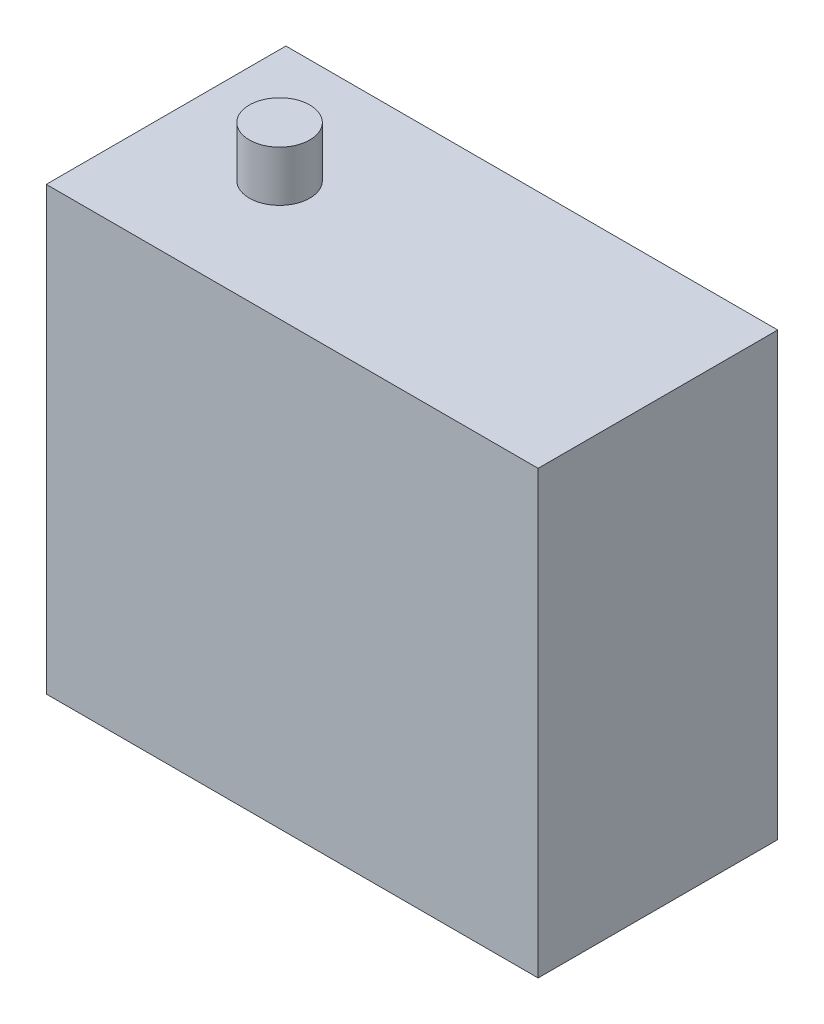
ISO-10303-21;
HEADER;
FILE_DESCRIPTION(('STEP AP214'),'2;1');
FILE_NAME('part.step','',(''),(''),'','','');
FILE_SCHEMA(('AUTOMOTIVE_DESIGN { 1 0 10303 214 1 1 1 1 }'));
ENDSEC;
DATA;
#1=APPLICATION_CONTEXT('core data for automotive mechanical design processes');
#2=APPLICATION_PROTOCOL_DEFINITION('international standard','automotive_design',2000,#1);
#3=PRODUCT_CONTEXT('',#1,'mechanical');
#4=PRODUCT('Part','Part','',(#3));
#5=PRODUCT_RELATED_PRODUCT_CATEGORY('part','',(#4));
#6=PRODUCT_DEFINITION_FORMATION('','',#4);
#7=PRODUCT_DEFINITION_CONTEXT('part definition',#1,'design');
#8=PRODUCT_DEFINITION('design','',#6,#7);
#9=PRODUCT_DEFINITION_SHAPE('','',#8);
#10=(LENGTH_UNIT() NAMED_UNIT(*) SI_UNIT(.MILLI.,.METRE.));
#11=(NAMED_UNIT(*) PLANE_ANGLE_UNIT() SI_UNIT($,.RADIAN.));
#12=(NAMED_UNIT(*) SI_UNIT($,.STERADIAN.) SOLID_ANGLE_UNIT());
#13=UNCERTAINTY_MEASURE_WITH_UNIT(LENGTH_MEASURE(1.E-05),#10,'distance_accuracy_value','');
#14=(GEOMETRIC_REPRESENTATION_CONTEXT(3) GLOBAL_UNCERTAINTY_ASSIGNED_CONTEXT((#13)) GLOBAL_UNIT_ASSIGNED_CONTEXT((#10,
#11,#12)) REPRESENTATION_CONTEXT('',''));
#15=CARTESIAN_POINT('',(0.,0.,0.));
#16=DIRECTION('',(0.,0.,1.));
#17=DIRECTION('',(1.,0.,0.));
#18=AXIS2_PLACEMENT_3D('',#15,#16,#17);
#19=CARTESIAN_POINT('',(-19.5,35.,9.50000000000001));
#20=DIRECTION('',(1.,0.,0.));
#21=DIRECTION('',(0.,0.,-1.));
#22=AXIS2_PLACEMENT_3D('',#19,#20,#21);
#23=PLANE('',#22);
#24=DIRECTION('',(0.,0.,1.));
#25=VECTOR('',#24,1.);
#26=CARTESIAN_POINT('',(-19.5,0.,9.50000000000001));
#27=LINE('',#26,#25);
#28=CARTESIAN_POINT('',(-19.5,0.,-9.49999999999999));
#29=VERTEX_POINT('',#28);
#30=CARTESIAN_POINT('',(-19.5,0.,9.50000000000001));
#31=VERTEX_POINT('',#30);
#32=EDGE_CURVE('E104',#29,#31,#27,.T.);
#33=ORIENTED_EDGE('',*,*,#32,.T.);
#34=DIRECTION('',(0.,-1.,0.));
#35=VECTOR('',#34,1.);
#36=CARTESIAN_POINT('',(-19.5,35.,9.50000000000001));
#37=LINE('',#36,#35);
#38=CARTESIAN_POINT('',(-19.5,35.,9.50000000000001));
#39=VERTEX_POINT('',#38);
#40=EDGE_CURVE('E11',#39,#31,#37,.T.);
#41=ORIENTED_EDGE('',*,*,#40,.F.);
#42=DIRECTION('',(0.,0.,1.));
#43=VECTOR('',#42,1.);
#44=CARTESIAN_POINT('',(-19.5,35.,9.50000000000001));
#45=LINE('',#44,#43);
#46=CARTESIAN_POINT('',(-19.5,35.,-9.49999999999999));
#47=VERTEX_POINT('',#46);
#48=EDGE_CURVE('E92',#47,#39,#45,.T.);
#49=ORIENTED_EDGE('',*,*,#48,.F.);
#50=DIRECTION('',(0.,-1.,0.));
#51=VECTOR('',#50,1.);
#52=CARTESIAN_POINT('',(-19.5,35.,-9.49999999999999));
#53=LINE('',#52,#51);
#54=EDGE_CURVE('E100',#47,#29,#53,.T.);
#55=ORIENTED_EDGE('',*,*,#54,.T.);
#56=EDGE_LOOP('',(#33,#41,#49,#55));
#57=FACE_BOUND('',#56,.T.);
#58=ADVANCED_FACE('F41',(#57),#23,.F.);
#59=CARTESIAN_POINT('',(19.5,35.,9.5));
#60=DIRECTION('',(0.,0.,-1.));
#61=DIRECTION('',(-1.,0.,0.));
#62=AXIS2_PLACEMENT_3D('',#59,#60,#61);
#63=PLANE('',#62);
#64=DIRECTION('',(1.,0.,0.));
#65=VECTOR('',#64,1.);
#66=CARTESIAN_POINT('',(19.5,0.,9.5));
#67=LINE('',#66,#65);
#68=CARTESIAN_POINT('',(19.5,0.,9.5));
#69=VERTEX_POINT('',#68);
#70=EDGE_CURVE('E96',#31,#69,#67,.T.);
#71=ORIENTED_EDGE('',*,*,#70,.T.);
#72=DIRECTION('',(0.,-1.,0.));
#73=VECTOR('',#72,1.);
#74=CARTESIAN_POINT('',(19.5,35.,9.5));
#75=LINE('',#74,#73);
#76=CARTESIAN_POINT('',(19.5,35.,9.5));
#77=VERTEX_POINT('',#76);
#78=EDGE_CURVE('E49',#77,#69,#75,.T.);
#79=ORIENTED_EDGE('',*,*,#78,.F.);
#80=DIRECTION('',(1.,0.,0.));
#81=VECTOR('',#80,1.);
#82=CARTESIAN_POINT('',(19.5,35.,9.5));
#83=LINE('',#82,#81);
#84=EDGE_CURVE('E87',#39,#77,#83,.T.);
#85=ORIENTED_EDGE('',*,*,#84,.F.);
#86=ORIENTED_EDGE('',*,*,#40,.T.);
#87=EDGE_LOOP('',(#71,#79,#85,#86));
#88=FACE_BOUND('',#87,.T.);
#89=ADVANCED_FACE('F95',(#88),#63,.F.);
#90=CARTESIAN_POINT('',(19.5,35.,9.5));
#91=DIRECTION('',(-1.,0.,0.));
#92=DIRECTION('',(0.,0.,1.));
#93=AXIS2_PLACEMENT_3D('',#90,#91,#92);
#94=PLANE('',#93);
#95=DIRECTION('',(0.,0.,-1.));
#96=VECTOR('',#95,1.);
#97=CARTESIAN_POINT('',(19.5,0.,9.5));
#98=LINE('',#97,#96);
#99=CARTESIAN_POINT('',(19.5,0.,-9.5));
#100=VERTEX_POINT('',#99);
#101=EDGE_CURVE('E74',#69,#100,#98,.T.);
#102=ORIENTED_EDGE('',*,*,#101,.T.);
#103=DIRECTION('',(0.,-1.,0.));
#104=VECTOR('',#103,1.);
#105=CARTESIAN_POINT('',(19.5,35.,-9.5));
#106=LINE('',#105,#104);
#107=CARTESIAN_POINT('',(19.5,35.,-9.5));
#108=VERTEX_POINT('',#107);
#109=EDGE_CURVE('E97',#108,#100,#106,.T.);
#110=ORIENTED_EDGE('',*,*,#109,.F.);
#111=DIRECTION('',(0.,0.,-1.));
#112=VECTOR('',#111,1.);
#113=CARTESIAN_POINT('',(19.5,35.,9.5));
#114=LINE('',#113,#112);
#115=EDGE_CURVE('E90',#77,#108,#114,.T.);
#116=ORIENTED_EDGE('',*,*,#115,.F.);
#117=ORIENTED_EDGE('',*,*,#78,.T.);
#118=EDGE_LOOP('',(#102,#110,#116,#117));
#119=FACE_BOUND('',#118,.T.);
#120=ADVANCED_FACE('F98',(#119),#94,.F.);
#121=CARTESIAN_POINT('',(19.5,35.,-9.5));
#122=DIRECTION('',(0.,0.,1.));
#123=DIRECTION('',(1.,0.,0.));
#124=AXIS2_PLACEMENT_3D('',#121,#122,#123);
#125=PLANE('',#124);
#126=DIRECTION('',(-1.,0.,0.));
#127=VECTOR('',#126,1.);
#128=CARTESIAN_POINT('',(19.5,0.,-9.5));
#129=LINE('',#128,#127);
#130=EDGE_CURVE('E80',#100,#29,#129,.T.);
#131=ORIENTED_EDGE('',*,*,#130,.T.);
#132=ORIENTED_EDGE('',*,*,#54,.F.);
#133=DIRECTION('',(-1.,0.,0.));
#134=VECTOR('',#133,1.);
#135=CARTESIAN_POINT('',(19.5,35.,-9.5));
#136=LINE('',#135,#134);
#137=EDGE_CURVE('E57',#108,#47,#136,.T.);
#138=ORIENTED_EDGE('',*,*,#137,.F.);
#139=ORIENTED_EDGE('',*,*,#109,.T.);
#140=EDGE_LOOP('',(#131,#132,#138,#139));
#141=FACE_BOUND('',#140,.T.);
#142=ADVANCED_FACE('F112',(#141),#125,.F.);
#143=CARTESIAN_POINT('',(0.,35.,0.));
#144=DIRECTION('',(0.,1.,0.));
#145=DIRECTION('',(0.,0.,1.));
#146=AXIS2_PLACEMENT_3D('',#143,#144,#145);
#147=PLANE('',#146);
#148=CARTESIAN_POINT('',(-10.5,35.,0.));
#149=DIRECTION('',(0.,1.,0.));
#150=DIRECTION('',(0.,0.,1.));
#151=AXIS2_PLACEMENT_3D('',#148,#149,#150);
#152=CIRCLE('',#151,2.4);
#153=CARTESIAN_POINT('',(-10.5,35.,2.4));
#154=VERTEX_POINT('',#153);
#155=EDGE_CURVE('E118',#154,#154,#152,.T.);
#156=ORIENTED_EDGE('',*,*,#155,.F.);
#157=EDGE_LOOP('',(#156));
#158=FACE_BOUND('',#157,.T.);
#159=ORIENTED_EDGE('',*,*,#48,.T.);
#160=ORIENTED_EDGE('',*,*,#84,.T.);
#161=ORIENTED_EDGE('',*,*,#115,.T.);
#162=ORIENTED_EDGE('',*,*,#137,.T.);
#163=EDGE_LOOP('',(#159,#160,#161,#162));
#164=FACE_BOUND('',#163,.T.);
#165=ADVANCED_FACE('F88',(#158,#164),#147,.T.);
#166=CARTESIAN_POINT('',(0.,0.,0.));
#167=DIRECTION('',(0.,1.,0.));
#168=DIRECTION('',(0.,0.,1.));
#169=AXIS2_PLACEMENT_3D('',#166,#167,#168);
#170=PLANE('',#169);
#171=ORIENTED_EDGE('',*,*,#32,.F.);
#172=ORIENTED_EDGE('',*,*,#130,.F.);
#173=ORIENTED_EDGE('',*,*,#101,.F.);
#174=ORIENTED_EDGE('',*,*,#70,.F.);
#175=EDGE_LOOP('',(#171,#172,#173,#174));
#176=FACE_BOUND('',#175,.T.);
#177=ADVANCED_FACE('F115',(#176),#170,.F.);
#178=CARTESIAN_POINT('',(-10.5,39.,0.));
#179=DIRECTION('',(0.,-1.,0.));
#180=DIRECTION('',(0.,0.,-1.));
#181=AXIS2_PLACEMENT_3D('',#178,#179,#180);
#182=CYLINDRICAL_SURFACE('',#181,2.4);
#183=CARTESIAN_POINT('',(-10.5,39.,0.));
#184=DIRECTION('',(0.,1.,0.));
#185=DIRECTION('',(0.,0.,1.));
#186=AXIS2_PLACEMENT_3D('',#183,#184,#185);
#187=CIRCLE('',#186,2.4);
#188=CARTESIAN_POINT('',(-10.5,39.,2.4));
#189=VERTEX_POINT('',#188);
#190=EDGE_CURVE('E107',#189,#189,#187,.T.);
#191=ORIENTED_EDGE('',*,*,#190,.F.);
#192=EDGE_LOOP('',(#191));
#193=FACE_BOUND('',#192,.T.);
#194=ORIENTED_EDGE('',*,*,#155,.T.);
#195=EDGE_LOOP('',(#194));
#196=FACE_BOUND('',#195,.T.);
#197=ADVANCED_FACE('F126',(#193,#196),#182,.T.);
#198=CARTESIAN_POINT('',(-10.5,39.,0.));
#199=DIRECTION('',(0.,1.,0.));
#200=DIRECTION('',(0.,0.,1.));
#201=AXIS2_PLACEMENT_3D('',#198,#199,#200);
#202=PLANE('',#201);
#203=ORIENTED_EDGE('',*,*,#190,.T.);
#204=EDGE_LOOP('',(#203));
#205=FACE_BOUND('',#204,.T.);
#206=ADVANCED_FACE('F124',(#205),#202,.T.);
#207=CLOSED_SHELL('',(#58,#89,#120,#142,#165,#177,#197,#206));
#208=MANIFOLD_SOLID_BREP('B2',#207);
#209=ADVANCED_BREP_SHAPE_REPRESENTATION('',(#18,#208),#14);
#210=SHAPE_DEFINITION_REPRESENTATION(#9,#209);
ENDSEC;
END-ISO-10303-21;
